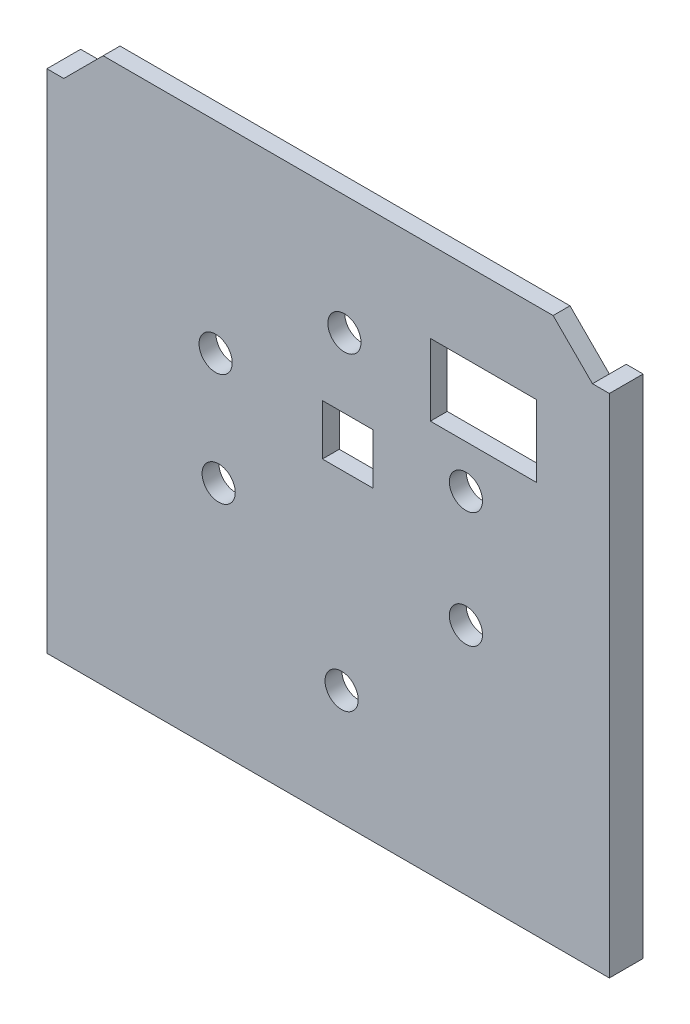
ISO-10303-21;
HEADER;
FILE_DESCRIPTION(('STEP AP214'),'2;1');
FILE_NAME('part.step','',(''),(''),'','','');
FILE_SCHEMA(('AUTOMOTIVE_DESIGN { 1 0 10303 214 1 1 1 1 }'));
ENDSEC;
DATA;
#1=APPLICATION_CONTEXT('core data for automotive mechanical design processes');
#2=APPLICATION_PROTOCOL_DEFINITION('international standard','automotive_design',2000,#1);
#3=PRODUCT_CONTEXT('',#1,'mechanical');
#4=PRODUCT('Part','Part','',(#3));
#5=PRODUCT_RELATED_PRODUCT_CATEGORY('part','',(#4));
#6=PRODUCT_DEFINITION_FORMATION('','',#4);
#7=PRODUCT_DEFINITION_CONTEXT('part definition',#1,'design');
#8=PRODUCT_DEFINITION('design','',#6,#7);
#9=PRODUCT_DEFINITION_SHAPE('','',#8);
#10=(LENGTH_UNIT() NAMED_UNIT(*) SI_UNIT(.MILLI.,.METRE.));
#11=(NAMED_UNIT(*) PLANE_ANGLE_UNIT() SI_UNIT($,.RADIAN.));
#12=(NAMED_UNIT(*) SI_UNIT($,.STERADIAN.) SOLID_ANGLE_UNIT());
#13=UNCERTAINTY_MEASURE_WITH_UNIT(LENGTH_MEASURE(1.E-05),#10,'distance_accuracy_value','');
#14=(GEOMETRIC_REPRESENTATION_CONTEXT(3) GLOBAL_UNCERTAINTY_ASSIGNED_CONTEXT((#13)) GLOBAL_UNIT_ASSIGNED_CONTEXT((#10,
#11,#12)) REPRESENTATION_CONTEXT('',''));
#15=CARTESIAN_POINT('',(0.,0.,0.));
#16=DIRECTION('',(0.,0.,1.));
#17=DIRECTION('',(1.,0.,0.));
#18=AXIS2_PLACEMENT_3D('',#15,#16,#17);
#19=CARTESIAN_POINT('',(0.,0.,2.84373961342499));
#20=DIRECTION('',(0.,0.,-1.));
#21=DIRECTION('',(-1.,0.,0.));
#22=AXIS2_PLACEMENT_3D('',#19,#20,#21);
#23=PLANE('',#22);
#24=DIRECTION('',(0.,-1.,0.));
#25=VECTOR('',#24,1.);
#26=CARTESIAN_POINT('',(3.24857673426605,27.3921139274678,2.84373961342499));
#27=LINE('',#26,#25);
#28=CARTESIAN_POINT('',(3.24857673426605,36.3921139274678,2.84373961342499));
#29=VERTEX_POINT('',#28);
#30=CARTESIAN_POINT('',(3.24857673426605,27.3921139274678,2.84373961342499));
#31=VERTEX_POINT('',#30);
#32=EDGE_CURVE('E253',#29,#31,#27,.T.);
#33=ORIENTED_EDGE('',*,*,#32,.F.);
#34=DIRECTION('',(-1.,0.,0.));
#35=VECTOR('',#34,1.);
#36=CARTESIAN_POINT('',(3.24857673426605,36.3921139274678,2.84373961342499));
#37=LINE('',#36,#35);
#38=CARTESIAN_POINT('',(12.248576734266,36.3921139274678,2.84373961342499));
#39=VERTEX_POINT('',#38);
#40=EDGE_CURVE('E261',#39,#29,#37,.T.);
#41=ORIENTED_EDGE('',*,*,#40,.F.);
#42=DIRECTION('',(0.,1.,0.));
#43=VECTOR('',#42,1.);
#44=CARTESIAN_POINT('',(12.248576734266,27.3921139274678,2.84373961342499));
#45=LINE('',#44,#43);
#46=CARTESIAN_POINT('',(12.248576734266,27.3921139274678,2.84373961342499));
#47=VERTEX_POINT('',#46);
#48=EDGE_CURVE('E258',#47,#39,#45,.T.);
#49=ORIENTED_EDGE('',*,*,#48,.F.);
#50=DIRECTION('',(1.,0.,0.));
#51=VECTOR('',#50,1.);
#52=CARTESIAN_POINT('',(3.24857673426605,27.3921139274678,2.84373961342499));
#53=LINE('',#52,#51);
#54=EDGE_CURVE('E255',#31,#47,#53,.T.);
#55=ORIENTED_EDGE('',*,*,#54,.F.);
#56=EDGE_LOOP('',(#33,#41,#49,#55));
#57=FACE_BOUND('',#56,.T.);
#58=DIRECTION('',(-1.,0.,0.));
#59=VECTOR('',#58,1.);
#60=CARTESIAN_POINT('',(51.2611254994336,62.988673094376,2.84373961342499));
#61=LINE('',#60,#59);
#62=CARTESIAN_POINT('',(54.2611254994336,62.988673094376,2.84373961342499));
#63=VERTEX_POINT('',#62);
#64=CARTESIAN_POINT('',(51.2611254994336,62.988673094376,2.84373961342499));
#65=VERTEX_POINT('',#64);
#66=EDGE_CURVE('E320',#63,#65,#61,.T.);
#67=ORIENTED_EDGE('',*,*,#66,.T.);
#68=DIRECTION('',(-0.707106781186551,0.707106781186544,0.));
#69=VECTOR('',#68,1.);
#70=CARTESIAN_POINT('',(51.2611254994336,62.988673094376,2.84373961342499));
#71=LINE('',#70,#69);
#72=CARTESIAN_POINT('',(44.2611254994336,69.9886730943761,2.84373961342499));
#73=VERTEX_POINT('',#72);
#74=EDGE_CURVE('E323',#65,#73,#71,.T.);
#75=ORIENTED_EDGE('',*,*,#74,.T.);
#76=DIRECTION('',(-1.,0.,0.));
#77=VECTOR('',#76,1.);
#78=CARTESIAN_POINT('',(-35.7388745005663,69.9886730943761,2.84373961342499));
#79=LINE('',#78,#77);
#80=CARTESIAN_POINT('',(-35.7388745005663,69.9886730943761,2.84373961342499));
#81=VERTEX_POINT('',#80);
#82=EDGE_CURVE('E326',#73,#81,#79,.T.);
#83=ORIENTED_EDGE('',*,*,#82,.T.);
#84=DIRECTION('',(-0.707106781186551,-0.707106781186544,0.));
#85=VECTOR('',#84,1.);
#86=CARTESIAN_POINT('',(-42.7388745005664,62.988673094376,2.84373961342499));
#87=LINE('',#86,#85);
#88=CARTESIAN_POINT('',(-42.7388745005664,62.988673094376,2.84373961342499));
#89=VERTEX_POINT('',#88);
#90=EDGE_CURVE('E328',#81,#89,#87,.T.);
#91=ORIENTED_EDGE('',*,*,#90,.T.);
#92=DIRECTION('',(-1.,0.,0.));
#93=VECTOR('',#92,1.);
#94=CARTESIAN_POINT('',(-42.7388745005664,62.988673094376,2.84373961342499));
#95=LINE('',#94,#93);
#96=CARTESIAN_POINT('',(-45.7388745005664,62.988673094376,2.84373961342499));
#97=VERTEX_POINT('',#96);
#98=EDGE_CURVE('E330',#89,#97,#95,.T.);
#99=ORIENTED_EDGE('',*,*,#98,.T.);
#100=DIRECTION('',(0.,-1.,0.));
#101=VECTOR('',#100,1.);
#102=CARTESIAN_POINT('',(-45.7388745005664,62.988673094376,2.84373961342499));
#103=LINE('',#102,#101);
#104=CARTESIAN_POINT('',(-45.7388745005664,-27.011326905624,2.84373961342499));
#105=VERTEX_POINT('',#104);
#106=EDGE_CURVE('E332',#97,#105,#103,.T.);
#107=ORIENTED_EDGE('',*,*,#106,.T.);
#108=DIRECTION('',(1.,0.,0.));
#109=VECTOR('',#108,1.);
#110=CARTESIAN_POINT('',(-45.7388745005664,-27.011326905624,2.84373961342499));
#111=LINE('',#110,#109);
#112=CARTESIAN_POINT('',(54.2611254994337,-27.011326905624,2.84373961342499));
#113=VERTEX_POINT('',#112);
#114=EDGE_CURVE('E334',#105,#113,#111,.T.);
#115=ORIENTED_EDGE('',*,*,#114,.T.);
#116=DIRECTION('',(0.,1.,0.));
#117=VECTOR('',#116,1.);
#118=CARTESIAN_POINT('',(54.2611254994336,62.988673094376,2.84373961342499));
#119=LINE('',#118,#117);
#120=EDGE_CURVE('E174',#113,#63,#119,.T.);
#121=ORIENTED_EDGE('',*,*,#120,.T.);
#122=EDGE_LOOP('',(#67,#75,#83,#91,#99,#107,#115,#121));
#123=FACE_BOUND('',#122,.T.);
#124=CARTESIAN_POINT('',(7.1611245312307,48.7704431449017,2.84373961342499));
#125=DIRECTION('',(0.,0.,1.));
#126=DIRECTION('',(1.,0.,0.));
#127=AXIS2_PLACEMENT_3D('',#124,#125,#126);
#128=CIRCLE('',#127,2.95000117238807);
#129=CARTESIAN_POINT('',(10.1111257036188,48.7704431449017,2.84373961342499));
#130=VERTEX_POINT('',#129);
#131=EDGE_CURVE('E314',#130,#130,#128,.T.);
#132=ORIENTED_EDGE('',*,*,#131,.F.);
#133=EDGE_LOOP('',(#132));
#134=FACE_BOUND('',#133,.T.);
#135=CARTESIAN_POINT('',(28.7611250915144,35.1704438959202,2.84373961342499));
#136=DIRECTION('',(0.,0.,1.));
#137=DIRECTION('',(1.,0.,0.));
#138=AXIS2_PLACEMENT_3D('',#135,#136,#137);
#139=CIRCLE('',#138,2.95000117238806);
#140=CARTESIAN_POINT('',(31.7111262639024,35.1704438959202,2.84373961342499));
#141=VERTEX_POINT('',#140);
#142=EDGE_CURVE('E308',#141,#141,#139,.T.);
#143=ORIENTED_EDGE('',*,*,#142,.F.);
#144=EDGE_LOOP('',(#143));
#145=FACE_BOUND('',#144,.T.);
#146=CARTESIAN_POINT('',(28.7611250915144,14.5704434995493,2.84373961342499));
#147=DIRECTION('',(0.,0.,1.));
#148=DIRECTION('',(1.,0.,0.));
#149=AXIS2_PLACEMENT_3D('',#146,#147,#148);
#150=CIRCLE('',#149,2.95000117238806);
#151=CARTESIAN_POINT('',(31.7111262639024,14.5704434995493,2.84373961342499));
#152=VERTEX_POINT('',#151);
#153=EDGE_CURVE('E302',#152,#152,#150,.T.);
#154=ORIENTED_EDGE('',*,*,#153,.F.);
#155=EDGE_LOOP('',(#154));
#156=FACE_BOUND('',#155,.T.);
#157=CARTESIAN_POINT('',(6.66112724324203,-6.52955907425374,2.84373961342499));
#158=DIRECTION('',(0.,0.,1.));
#159=DIRECTION('',(1.,0.,0.));
#160=AXIS2_PLACEMENT_3D('',#157,#158,#159);
#161=CIRCLE('',#160,2.95000117238807);
#162=CARTESIAN_POINT('',(9.6111284156301,-6.52955907425374,2.84373961342499));
#163=VERTEX_POINT('',#162);
#164=EDGE_CURVE('E296',#163,#163,#161,.T.);
#165=ORIENTED_EDGE('',*,*,#164,.F.);
#166=EDGE_LOOP('',(#165));
#167=FACE_BOUND('',#166,.T.);
#168=CARTESIAN_POINT('',(-15.1988725028422,14.4704436694226,2.84373961342499));
#169=DIRECTION('',(0.,0.,1.));
#170=DIRECTION('',(1.,0.,0.));
#171=AXIS2_PLACEMENT_3D('',#168,#169,#170);
#172=CIRCLE('',#171,2.95000117238807);
#173=CARTESIAN_POINT('',(-12.2488713304541,14.4704436694226,2.84373961342499));
#174=VERTEX_POINT('',#173);
#175=EDGE_CURVE('E290',#174,#174,#172,.T.);
#176=ORIENTED_EDGE('',*,*,#175,.F.);
#177=EDGE_LOOP('',(#176));
#178=FACE_BOUND('',#177,.T.);
#179=CARTESIAN_POINT('',(-15.738875683346,34.1704455946526,2.84373961342499));
#180=DIRECTION('',(0.,0.,1.));
#181=DIRECTION('',(1.,0.,0.));
#182=AXIS2_PLACEMENT_3D('',#179,#180,#181);
#183=CIRCLE('',#182,2.95000117238807);
#184=CARTESIAN_POINT('',(-12.788874510958,34.1704455946526,2.84373961342499));
#185=VERTEX_POINT('',#184);
#186=EDGE_CURVE('E284',#185,#185,#183,.T.);
#187=ORIENTED_EDGE('',*,*,#186,.F.);
#188=EDGE_LOOP('',(#187));
#189=FACE_BOUND('',#188,.T.);
#190=DIRECTION('',(0.,-1.,0.));
#191=VECTOR('',#190,1.);
#192=CARTESIAN_POINT('',(22.4361260571096,55.5636739169201,2.84373961342499));
#193=LINE('',#192,#191);
#194=CARTESIAN_POINT('',(22.4361260571096,55.5636739169201,2.84373961342499));
#195=VERTEX_POINT('',#194);
#196=CARTESIAN_POINT('',(22.4361260571096,42.8136741553387,2.84373961342499));
#197=VERTEX_POINT('',#196);
#198=EDGE_CURVE('E224',#195,#197,#193,.T.);
#199=ORIENTED_EDGE('',*,*,#198,.F.);
#200=DIRECTION('',(-1.,0.,0.));
#201=VECTOR('',#200,1.);
#202=CARTESIAN_POINT('',(22.4361260571096,55.5636739169201,2.84373961342499));
#203=LINE('',#202,#201);
#204=CARTESIAN_POINT('',(41.2861257009719,55.5636739169201,2.84373961342499));
#205=VERTEX_POINT('',#204);
#206=EDGE_CURVE('E231',#205,#195,#203,.T.);
#207=ORIENTED_EDGE('',*,*,#206,.F.);
#208=DIRECTION('',(0.,1.,0.));
#209=VECTOR('',#208,1.);
#210=CARTESIAN_POINT('',(41.2861257009719,55.5636739169201,2.84373961342499));
#211=LINE('',#210,#209);
#212=CARTESIAN_POINT('',(41.2861257009719,42.8136741553387,2.84373961342499));
#213=VERTEX_POINT('',#212);
#214=EDGE_CURVE('E229',#213,#205,#211,.T.);
#215=ORIENTED_EDGE('',*,*,#214,.F.);
#216=DIRECTION('',(1.,0.,0.));
#217=VECTOR('',#216,1.);
#218=CARTESIAN_POINT('',(22.4361260571096,42.8136741553387,2.84373961342499));
#219=LINE('',#218,#217);
#220=EDGE_CURVE('E226',#197,#213,#219,.T.);
#221=ORIENTED_EDGE('',*,*,#220,.F.);
#222=EDGE_LOOP('',(#199,#207,#215,#221));
#223=FACE_BOUND('',#222,.T.);
#224=ADVANCED_FACE('F36',(#57,#123,#134,#145,#156,#167,#178,#189,#223),#23,.F.);
#225=CARTESIAN_POINT('',(0.,0.,-0.156260386575012));
#226=DIRECTION('',(0.,0.,-1.));
#227=DIRECTION('',(-1.,0.,0.));
#228=AXIS2_PLACEMENT_3D('',#225,#226,#227);
#229=PLANE('',#228);
#230=DIRECTION('',(0.,1.,0.));
#231=VECTOR('',#230,1.);
#232=CARTESIAN_POINT('',(51.2611254994336,62.988673094376,-0.156260386575012));
#233=LINE('',#232,#231);
#234=CARTESIAN_POINT('',(51.2611254994336,-24.011326905624,-0.156260386575012));
#235=VERTEX_POINT('',#234);
#236=CARTESIAN_POINT('',(51.2611254994336,62.988673094376,-0.156260386575012));
#237=VERTEX_POINT('',#236);
#238=EDGE_CURVE('E51',#235,#237,#233,.T.);
#239=ORIENTED_EDGE('',*,*,#238,.F.);
#240=DIRECTION('',(1.,0.,0.));
#241=VECTOR('',#240,1.);
#242=CARTESIAN_POINT('',(51.2611254994336,-24.011326905624,-0.156260386575012));
#243=LINE('',#242,#241);
#244=CARTESIAN_POINT('',(-42.7388745005664,-24.011326905624,-0.156260386575012));
#245=VERTEX_POINT('',#244);
#246=EDGE_CURVE('E194',#245,#235,#243,.T.);
#247=ORIENTED_EDGE('',*,*,#246,.F.);
#248=DIRECTION('',(0.,-1.,0.));
#249=VECTOR('',#248,1.);
#250=CARTESIAN_POINT('',(-42.7388745005664,-24.011326905624,-0.156260386575012));
#251=LINE('',#250,#249);
#252=CARTESIAN_POINT('',(-42.7388745005664,62.988673094376,-0.156260386575012));
#253=VERTEX_POINT('',#252);
#254=EDGE_CURVE('E208',#253,#245,#251,.T.);
#255=ORIENTED_EDGE('',*,*,#254,.F.);
#256=DIRECTION('',(-0.707106781186551,-0.707106781186544,0.));
#257=VECTOR('',#256,1.);
#258=CARTESIAN_POINT('',(-42.7388745005664,62.988673094376,-0.156260386575012));
#259=LINE('',#258,#257);
#260=CARTESIAN_POINT('',(-35.7388745005663,69.9886730943761,-0.156260386575012));
#261=VERTEX_POINT('',#260);
#262=EDGE_CURVE('E324',#261,#253,#259,.T.);
#263=ORIENTED_EDGE('',*,*,#262,.F.);
#264=DIRECTION('',(-1.,0.,0.));
#265=VECTOR('',#264,1.);
#266=CARTESIAN_POINT('',(-35.7388745005663,69.9886730943761,-0.156260386575012));
#267=LINE('',#266,#265);
#268=CARTESIAN_POINT('',(44.2611254994336,69.9886730943761,-0.156260386575012));
#269=VERTEX_POINT('',#268);
#270=EDGE_CURVE('E338',#269,#261,#267,.T.);
#271=ORIENTED_EDGE('',*,*,#270,.F.);
#272=DIRECTION('',(-0.707106781186551,0.707106781186544,0.));
#273=VECTOR('',#272,1.);
#274=CARTESIAN_POINT('',(51.2611254994336,62.988673094376,-0.156260386575012));
#275=LINE('',#274,#273);
#276=EDGE_CURVE('E317',#237,#269,#275,.T.);
#277=ORIENTED_EDGE('',*,*,#276,.F.);
#278=EDGE_LOOP('',(#239,#247,#255,#263,#271,#277));
#279=FACE_BOUND('',#278,.T.);
#280=CARTESIAN_POINT('',(-15.1988725028422,14.4704436694226,-0.156260386575012));
#281=DIRECTION('',(0.,0.,1.));
#282=DIRECTION('',(1.,0.,0.));
#283=AXIS2_PLACEMENT_3D('',#280,#281,#282);
#284=CIRCLE('',#283,2.95000117238807);
#285=CARTESIAN_POINT('',(-12.2488713304541,14.4704436694226,-0.156260386575012));
#286=VERTEX_POINT('',#285);
#287=EDGE_CURVE('E287',#286,#286,#284,.T.);
#288=ORIENTED_EDGE('',*,*,#287,.T.);
#289=EDGE_LOOP('',(#288));
#290=FACE_BOUND('',#289,.T.);
#291=CARTESIAN_POINT('',(28.7611250915144,14.5704434995493,-0.156260386575012));
#292=DIRECTION('',(0.,0.,1.));
#293=DIRECTION('',(1.,0.,0.));
#294=AXIS2_PLACEMENT_3D('',#291,#292,#293);
#295=CIRCLE('',#294,2.95000117238806);
#296=CARTESIAN_POINT('',(31.7111262639024,14.5704434995493,-0.156260386575012));
#297=VERTEX_POINT('',#296);
#298=EDGE_CURVE('E299',#297,#297,#295,.T.);
#299=ORIENTED_EDGE('',*,*,#298,.T.);
#300=EDGE_LOOP('',(#299));
#301=FACE_BOUND('',#300,.T.);
#302=CARTESIAN_POINT('',(7.1611245312307,48.7704431449017,-0.156260386575012));
#303=DIRECTION('',(0.,0.,1.));
#304=DIRECTION('',(1.,0.,0.));
#305=AXIS2_PLACEMENT_3D('',#302,#303,#304);
#306=CIRCLE('',#305,2.95000117238807);
#307=CARTESIAN_POINT('',(10.1111257036188,48.7704431449017,-0.156260386575012));
#308=VERTEX_POINT('',#307);
#309=EDGE_CURVE('E311',#308,#308,#306,.T.);
#310=ORIENTED_EDGE('',*,*,#309,.T.);
#311=EDGE_LOOP('',(#310));
#312=FACE_BOUND('',#311,.T.);
#313=CARTESIAN_POINT('',(28.7611250915144,35.1704438959202,-0.156260386575012));
#314=DIRECTION('',(0.,0.,1.));
#315=DIRECTION('',(1.,0.,0.));
#316=AXIS2_PLACEMENT_3D('',#313,#314,#315);
#317=CIRCLE('',#316,2.95000117238806);
#318=CARTESIAN_POINT('',(31.7111262639024,35.1704438959202,-0.156260386575012));
#319=VERTEX_POINT('',#318);
#320=EDGE_CURVE('E305',#319,#319,#317,.T.);
#321=ORIENTED_EDGE('',*,*,#320,.T.);
#322=EDGE_LOOP('',(#321));
#323=FACE_BOUND('',#322,.T.);
#324=CARTESIAN_POINT('',(6.66112724324203,-6.52955907425374,-0.156260386575012));
#325=DIRECTION('',(0.,0.,1.));
#326=DIRECTION('',(1.,0.,0.));
#327=AXIS2_PLACEMENT_3D('',#324,#325,#326);
#328=CIRCLE('',#327,2.95000117238807);
#329=CARTESIAN_POINT('',(9.6111284156301,-6.52955907425374,-0.156260386575012));
#330=VERTEX_POINT('',#329);
#331=EDGE_CURVE('E293',#330,#330,#328,.T.);
#332=ORIENTED_EDGE('',*,*,#331,.T.);
#333=EDGE_LOOP('',(#332));
#334=FACE_BOUND('',#333,.T.);
#335=CARTESIAN_POINT('',(-15.738875683346,34.1704455946526,-0.156260386575012));
#336=DIRECTION('',(0.,0.,1.));
#337=DIRECTION('',(1.,0.,0.));
#338=AXIS2_PLACEMENT_3D('',#335,#336,#337);
#339=CIRCLE('',#338,2.95000117238807);
#340=CARTESIAN_POINT('',(-12.788874510958,34.1704455946526,-0.156260386575012));
#341=VERTEX_POINT('',#340);
#342=EDGE_CURVE('E283',#341,#341,#339,.T.);
#343=ORIENTED_EDGE('',*,*,#342,.T.);
#344=EDGE_LOOP('',(#343));
#345=FACE_BOUND('',#344,.T.);
#346=DIRECTION('',(-1.,0.,0.));
#347=VECTOR('',#346,1.);
#348=CARTESIAN_POINT('',(3.24857673426605,36.3921139274678,-0.156260386575012));
#349=LINE('',#348,#347);
#350=CARTESIAN_POINT('',(12.248576734266,36.3921139274678,-0.156260386575012));
#351=VERTEX_POINT('',#350);
#352=CARTESIAN_POINT('',(3.24857673426605,36.3921139274678,-0.156260386575012));
#353=VERTEX_POINT('',#352);
#354=EDGE_CURVE('E256',#351,#353,#349,.T.);
#355=ORIENTED_EDGE('',*,*,#354,.T.);
#356=DIRECTION('',(0.,-1.,0.));
#357=VECTOR('',#356,1.);
#358=CARTESIAN_POINT('',(3.24857673426605,27.3921139274678,-0.156260386575012));
#359=LINE('',#358,#357);
#360=CARTESIAN_POINT('',(3.24857673426605,27.3921139274678,-0.156260386575012));
#361=VERTEX_POINT('',#360);
#362=EDGE_CURVE('E252',#353,#361,#359,.T.);
#363=ORIENTED_EDGE('',*,*,#362,.T.);
#364=DIRECTION('',(1.,0.,0.));
#365=VECTOR('',#364,1.);
#366=CARTESIAN_POINT('',(3.24857673426605,27.3921139274678,-0.156260386575012));
#367=LINE('',#366,#365);
#368=CARTESIAN_POINT('',(12.248576734266,27.3921139274678,-0.156260386575012));
#369=VERTEX_POINT('',#368);
#370=EDGE_CURVE('E266',#361,#369,#367,.T.);
#371=ORIENTED_EDGE('',*,*,#370,.T.);
#372=DIRECTION('',(0.,1.,0.));
#373=VECTOR('',#372,1.);
#374=CARTESIAN_POINT('',(12.248576734266,27.3921139274678,-0.156260386575012));
#375=LINE('',#374,#373);
#376=EDGE_CURVE('E269',#369,#351,#375,.T.);
#377=ORIENTED_EDGE('',*,*,#376,.T.);
#378=EDGE_LOOP('',(#355,#363,#371,#377));
#379=FACE_BOUND('',#378,.T.);
#380=DIRECTION('',(-1.,0.,0.));
#381=VECTOR('',#380,1.);
#382=CARTESIAN_POINT('',(22.4361260571096,55.5636739169201,-0.156260386575012));
#383=LINE('',#382,#381);
#384=CARTESIAN_POINT('',(41.2861257009719,55.5636739169201,-0.156260386575012));
#385=VERTEX_POINT('',#384);
#386=CARTESIAN_POINT('',(22.4361260571096,55.5636739169201,-0.156260386575012));
#387=VERTEX_POINT('',#386);
#388=EDGE_CURVE('E227',#385,#387,#383,.T.);
#389=ORIENTED_EDGE('',*,*,#388,.T.);
#390=DIRECTION('',(0.,-1.,0.));
#391=VECTOR('',#390,1.);
#392=CARTESIAN_POINT('',(22.4361260571096,55.5636739169201,-0.156260386575012));
#393=LINE('',#392,#391);
#394=CARTESIAN_POINT('',(22.4361260571096,42.8136741553387,-0.156260386575012));
#395=VERTEX_POINT('',#394);
#396=EDGE_CURVE('E223',#387,#395,#393,.T.);
#397=ORIENTED_EDGE('',*,*,#396,.T.);
#398=DIRECTION('',(1.,0.,0.));
#399=VECTOR('',#398,1.);
#400=CARTESIAN_POINT('',(22.4361260571096,42.8136741553387,-0.156260386575012));
#401=LINE('',#400,#399);
#402=CARTESIAN_POINT('',(41.2861257009719,42.8136741553387,-0.156260386575012));
#403=VERTEX_POINT('',#402);
#404=EDGE_CURVE('E236',#395,#403,#401,.T.);
#405=ORIENTED_EDGE('',*,*,#404,.T.);
#406=DIRECTION('',(0.,1.,0.));
#407=VECTOR('',#406,1.);
#408=CARTESIAN_POINT('',(41.2861257009719,55.5636739169201,-0.156260386575012));
#409=LINE('',#408,#407);
#410=EDGE_CURVE('E239',#403,#385,#409,.T.);
#411=ORIENTED_EDGE('',*,*,#410,.T.);
#412=EDGE_LOOP('',(#389,#397,#405,#411));
#413=FACE_BOUND('',#412,.T.);
#414=ADVANCED_FACE('F360',(#279,#290,#301,#312,#323,#334,#345,#379,#413),#229,.T.);
#415=CARTESIAN_POINT('',(51.2611254994336,62.988673094376,2.84373961342499));
#416=DIRECTION('',(0.,-1.,0.));
#417=DIRECTION('',(0.,0.,-1.));
#418=AXIS2_PLACEMENT_3D('',#415,#416,#417);
#419=PLANE('',#418);
#420=DIRECTION('',(0.,0.,-1.));
#421=VECTOR('',#420,1.);
#422=CARTESIAN_POINT('',(54.2611254994336,62.988673094376,2.84373961342499));
#423=LINE('',#422,#421);
#424=CARTESIAN_POINT('',(54.2611254994336,62.988673094376,-3.15626038657501));
#425=VERTEX_POINT('',#424);
#426=EDGE_CURVE('E178',#63,#425,#423,.T.);
#427=ORIENTED_EDGE('',*,*,#426,.T.);
#428=DIRECTION('',(1.,0.,0.));
#429=VECTOR('',#428,1.);
#430=CARTESIAN_POINT('',(54.2611254994336,62.988673094376,-3.15626038657501));
#431=LINE('',#430,#429);
#432=CARTESIAN_POINT('',(51.2611254994336,62.988673094376,-3.15626038657501));
#433=VERTEX_POINT('',#432);
#434=EDGE_CURVE('E192',#433,#425,#431,.T.);
#435=ORIENTED_EDGE('',*,*,#434,.F.);
#436=DIRECTION('',(0.,0.,1.));
#437=VECTOR('',#436,1.);
#438=CARTESIAN_POINT('',(51.2611254994336,62.988673094376,-3.15626038657501));
#439=LINE('',#438,#437);
#440=EDGE_CURVE('E207',#433,#237,#439,.T.);
#441=ORIENTED_EDGE('',*,*,#440,.T.);
#442=DIRECTION('',(0.,0.,-1.));
#443=VECTOR('',#442,1.);
#444=CARTESIAN_POINT('',(51.2611254994336,62.988673094376,2.84373961342499));
#445=LINE('',#444,#443);
#446=EDGE_CURVE('E11',#65,#237,#445,.T.);
#447=ORIENTED_EDGE('',*,*,#446,.F.);
#448=ORIENTED_EDGE('',*,*,#66,.F.);
#449=EDGE_LOOP('',(#427,#435,#441,#447,#448));
#450=FACE_BOUND('',#449,.T.);
#451=ADVANCED_FACE('F38',(#450),#419,.F.);
#452=CARTESIAN_POINT('',(51.2611254994336,62.988673094376,2.84373961342499));
#453=DIRECTION('',(-0.707106781186544,-0.707106781186551,0.));
#454=DIRECTION('',(0.707106781186551,-0.707106781186544,0.));
#455=AXIS2_PLACEMENT_3D('',#452,#453,#454);
#456=PLANE('',#455);
#457=ORIENTED_EDGE('',*,*,#276,.T.);
#458=DIRECTION('',(0.,0.,-1.));
#459=VECTOR('',#458,1.);
#460=CARTESIAN_POINT('',(44.2611254994336,69.9886730943761,2.84373961342499));
#461=LINE('',#460,#459);
#462=EDGE_CURVE('E44',#73,#269,#461,.T.);
#463=ORIENTED_EDGE('',*,*,#462,.F.);
#464=ORIENTED_EDGE('',*,*,#74,.F.);
#465=ORIENTED_EDGE('',*,*,#446,.T.);
#466=EDGE_LOOP('',(#457,#463,#464,#465));
#467=FACE_BOUND('',#466,.T.);
#468=ADVANCED_FACE('F385',(#467),#456,.F.);
#469=CARTESIAN_POINT('',(-35.7388745005663,69.9886730943761,2.84373961342499));
#470=DIRECTION('',(0.,-1.,0.));
#471=DIRECTION('',(0.,0.,-1.));
#472=AXIS2_PLACEMENT_3D('',#469,#470,#471);
#473=PLANE('',#472);
#474=ORIENTED_EDGE('',*,*,#270,.T.);
#475=DIRECTION('',(0.,0.,-1.));
#476=VECTOR('',#475,1.);
#477=CARTESIAN_POINT('',(-35.7388745005663,69.9886730943761,2.84373961342499));
#478=LINE('',#477,#476);
#479=EDGE_CURVE('E349',#81,#261,#478,.T.);
#480=ORIENTED_EDGE('',*,*,#479,.F.);
#481=ORIENTED_EDGE('',*,*,#82,.F.);
#482=ORIENTED_EDGE('',*,*,#462,.T.);
#483=EDGE_LOOP('',(#474,#480,#481,#482));
#484=FACE_BOUND('',#483,.T.);
#485=ADVANCED_FACE('F356',(#484),#473,.F.);
#486=CARTESIAN_POINT('',(-42.7388745005664,62.988673094376,2.84373961342499));
#487=DIRECTION('',(0.707106781186544,-0.707106781186551,0.));
#488=DIRECTION('',(0.707106781186551,0.707106781186544,0.));
#489=AXIS2_PLACEMENT_3D('',#486,#487,#488);
#490=PLANE('',#489);
#491=ORIENTED_EDGE('',*,*,#262,.T.);
#492=DIRECTION('',(0.,0.,-1.));
#493=VECTOR('',#492,1.);
#494=CARTESIAN_POINT('',(-42.7388745005664,62.988673094376,2.84373961342499));
#495=LINE('',#494,#493);
#496=EDGE_CURVE('E346',#89,#253,#495,.T.);
#497=ORIENTED_EDGE('',*,*,#496,.F.);
#498=ORIENTED_EDGE('',*,*,#90,.F.);
#499=ORIENTED_EDGE('',*,*,#479,.T.);
#500=EDGE_LOOP('',(#491,#497,#498,#499));
#501=FACE_BOUND('',#500,.T.);
#502=ADVANCED_FACE('F364',(#501),#490,.F.);
#503=CARTESIAN_POINT('',(-42.7388745005664,62.988673094376,2.84373961342499));
#504=DIRECTION('',(0.,-1.,0.));
#505=DIRECTION('',(0.,0.,-1.));
#506=AXIS2_PLACEMENT_3D('',#503,#504,#505);
#507=PLANE('',#506);
#508=ORIENTED_EDGE('',*,*,#496,.T.);
#509=DIRECTION('',(0.,0.,1.));
#510=VECTOR('',#509,1.);
#511=CARTESIAN_POINT('',(-42.7388745005664,62.988673094376,-3.15626038657501));
#512=LINE('',#511,#510);
#513=CARTESIAN_POINT('',(-42.7388745005664,62.988673094376,-3.15626038657501));
#514=VERTEX_POINT('',#513);
#515=EDGE_CURVE('E220',#514,#253,#512,.T.);
#516=ORIENTED_EDGE('',*,*,#515,.F.);
#517=DIRECTION('',(1.,0.,0.));
#518=VECTOR('',#517,1.);
#519=CARTESIAN_POINT('',(-42.7388745005664,62.988673094376,-3.15626038657501));
#520=LINE('',#519,#518);
#521=CARTESIAN_POINT('',(-45.7388745005664,62.988673094376,-3.15626038657501));
#522=VERTEX_POINT('',#521);
#523=EDGE_CURVE('E198',#522,#514,#520,.T.);
#524=ORIENTED_EDGE('',*,*,#523,.F.);
#525=DIRECTION('',(0.,0.,-1.));
#526=VECTOR('',#525,1.);
#527=CARTESIAN_POINT('',(-45.7388745005664,62.988673094376,2.84373961342499));
#528=LINE('',#527,#526);
#529=EDGE_CURVE('E344',#97,#522,#528,.T.);
#530=ORIENTED_EDGE('',*,*,#529,.F.);
#531=ORIENTED_EDGE('',*,*,#98,.F.);
#532=EDGE_LOOP('',(#508,#516,#524,#530,#531));
#533=FACE_BOUND('',#532,.T.);
#534=ADVANCED_FACE('F369',(#533),#507,.F.);
#535=CARTESIAN_POINT('',(-45.7388745005664,62.988673094376,2.84373961342499));
#536=DIRECTION('',(1.,0.,0.));
#537=DIRECTION('',(0.,1.,0.));
#538=AXIS2_PLACEMENT_3D('',#535,#536,#537);
#539=PLANE('',#538);
#540=ORIENTED_EDGE('',*,*,#529,.T.);
#541=DIRECTION('',(0.,1.,0.));
#542=VECTOR('',#541,1.);
#543=CARTESIAN_POINT('',(-45.7388745005664,62.988673094376,-3.15626038657501));
#544=LINE('',#543,#542);
#545=CARTESIAN_POINT('',(-45.7388745005664,-27.011326905624,-3.15626038657501));
#546=VERTEX_POINT('',#545);
#547=EDGE_CURVE('E187',#546,#522,#544,.T.);
#548=ORIENTED_EDGE('',*,*,#547,.F.);
#549=DIRECTION('',(0.,0.,-1.));
#550=VECTOR('',#549,1.);
#551=CARTESIAN_POINT('',(-45.7388745005664,-27.011326905624,2.84373961342499));
#552=LINE('',#551,#550);
#553=EDGE_CURVE('E177',#105,#546,#552,.T.);
#554=ORIENTED_EDGE('',*,*,#553,.F.);
#555=ORIENTED_EDGE('',*,*,#106,.F.);
#556=EDGE_LOOP('',(#540,#548,#554,#555));
#557=FACE_BOUND('',#556,.T.);
#558=ADVANCED_FACE('F380',(#557),#539,.F.);
#559=CARTESIAN_POINT('',(-45.7388745005664,-27.011326905624,2.84373961342499));
#560=DIRECTION('',(0.,1.,0.));
#561=DIRECTION('',(-1.,0.,0.));
#562=AXIS2_PLACEMENT_3D('',#559,#560,#561);
#563=PLANE('',#562);
#564=ORIENTED_EDGE('',*,*,#553,.T.);
#565=DIRECTION('',(-1.,0.,0.));
#566=VECTOR('',#565,1.);
#567=CARTESIAN_POINT('',(-45.7388745005664,-27.011326905624,-3.15626038657501));
#568=LINE('',#567,#566);
#569=CARTESIAN_POINT('',(54.2611254994337,-27.011326905624,-3.15626038657501));
#570=VERTEX_POINT('',#569);
#571=EDGE_CURVE('E181',#570,#546,#568,.T.);
#572=ORIENTED_EDGE('',*,*,#571,.F.);
#573=DIRECTION('',(0.,0.,-1.));
#574=VECTOR('',#573,1.);
#575=CARTESIAN_POINT('',(54.2611254994337,-27.011326905624,2.84373961342499));
#576=LINE('',#575,#574);
#577=EDGE_CURVE('E168',#113,#570,#576,.T.);
#578=ORIENTED_EDGE('',*,*,#577,.F.);
#579=ORIENTED_EDGE('',*,*,#114,.F.);
#580=EDGE_LOOP('',(#564,#572,#578,#579));
#581=FACE_BOUND('',#580,.T.);
#582=ADVANCED_FACE('F182',(#581),#563,.F.);
#583=CARTESIAN_POINT('',(54.2611254994336,62.988673094376,2.84373961342499));
#584=DIRECTION('',(-1.,0.,0.));
#585=DIRECTION('',(0.,-1.,0.));
#586=AXIS2_PLACEMENT_3D('',#583,#584,#585);
#587=PLANE('',#586);
#588=ORIENTED_EDGE('',*,*,#577,.T.);
#589=DIRECTION('',(0.,-1.,0.));
#590=VECTOR('',#589,1.);
#591=CARTESIAN_POINT('',(54.2611254994337,-27.011326905624,-3.15626038657501));
#592=LINE('',#591,#590);
#593=EDGE_CURVE('E173',#425,#570,#592,.T.);
#594=ORIENTED_EDGE('',*,*,#593,.F.);
#595=ORIENTED_EDGE('',*,*,#426,.F.);
#596=ORIENTED_EDGE('',*,*,#120,.F.);
#597=EDGE_LOOP('',(#588,#594,#595,#596));
#598=FACE_BOUND('',#597,.T.);
#599=ADVANCED_FACE('F170',(#598),#587,.F.);
#600=CARTESIAN_POINT('',(7.1611245312307,48.7704431449017,2.84373961342499));
#601=DIRECTION('',(0.,0.,-1.));
#602=DIRECTION('',(-1.,0.,0.));
#603=AXIS2_PLACEMENT_3D('',#600,#601,#602);
#604=CYLINDRICAL_SURFACE('',#603,2.95000117238807);
#605=ORIENTED_EDGE('',*,*,#131,.T.);
#606=EDGE_LOOP('',(#605));
#607=FACE_BOUND('',#606,.T.);
#608=ORIENTED_EDGE('',*,*,#309,.F.);
#609=EDGE_LOOP('',(#608));
#610=FACE_BOUND('',#609,.T.);
#611=ADVANCED_FACE('F404',(#607,#610),#604,.F.);
#612=CARTESIAN_POINT('',(28.7611250915144,35.1704438959202,2.84373961342499));
#613=DIRECTION('',(0.,0.,-1.));
#614=DIRECTION('',(-1.,0.,0.));
#615=AXIS2_PLACEMENT_3D('',#612,#613,#614);
#616=CYLINDRICAL_SURFACE('',#615,2.95000117238806);
#617=ORIENTED_EDGE('',*,*,#142,.T.);
#618=EDGE_LOOP('',(#617));
#619=FACE_BOUND('',#618,.T.);
#620=ORIENTED_EDGE('',*,*,#320,.F.);
#621=EDGE_LOOP('',(#620));
#622=FACE_BOUND('',#621,.T.);
#623=ADVANCED_FACE('F449',(#619,#622),#616,.F.);
#624=CARTESIAN_POINT('',(28.7611250915144,14.5704434995493,2.84373961342499));
#625=DIRECTION('',(0.,0.,-1.));
#626=DIRECTION('',(-1.,0.,0.));
#627=AXIS2_PLACEMENT_3D('',#624,#625,#626);
#628=CYLINDRICAL_SURFACE('',#627,2.95000117238806);
#629=ORIENTED_EDGE('',*,*,#153,.T.);
#630=EDGE_LOOP('',(#629));
#631=FACE_BOUND('',#630,.T.);
#632=ORIENTED_EDGE('',*,*,#298,.F.);
#633=EDGE_LOOP('',(#632));
#634=FACE_BOUND('',#633,.T.);
#635=ADVANCED_FACE('F456',(#631,#634),#628,.F.);
#636=CARTESIAN_POINT('',(6.66112724324203,-6.52955907425374,2.84373961342499));
#637=DIRECTION('',(0.,0.,-1.));
#638=DIRECTION('',(-1.,0.,0.));
#639=AXIS2_PLACEMENT_3D('',#636,#637,#638);
#640=CYLINDRICAL_SURFACE('',#639,2.95000117238807);
#641=ORIENTED_EDGE('',*,*,#164,.T.);
#642=EDGE_LOOP('',(#641));
#643=FACE_BOUND('',#642,.T.);
#644=ORIENTED_EDGE('',*,*,#331,.F.);
#645=EDGE_LOOP('',(#644));
#646=FACE_BOUND('',#645,.T.);
#647=ADVANCED_FACE('F463',(#643,#646),#640,.F.);
#648=CARTESIAN_POINT('',(-15.1988725028422,14.4704436694226,2.84373961342499));
#649=DIRECTION('',(0.,0.,-1.));
#650=DIRECTION('',(-1.,0.,0.));
#651=AXIS2_PLACEMENT_3D('',#648,#649,#650);
#652=CYLINDRICAL_SURFACE('',#651,2.95000117238807);
#653=ORIENTED_EDGE('',*,*,#175,.T.);
#654=EDGE_LOOP('',(#653));
#655=FACE_BOUND('',#654,.T.);
#656=ORIENTED_EDGE('',*,*,#287,.F.);
#657=EDGE_LOOP('',(#656));
#658=FACE_BOUND('',#657,.T.);
#659=ADVANCED_FACE('F471',(#655,#658),#652,.F.);
#660=CARTESIAN_POINT('',(-15.738875683346,34.1704455946526,2.84373961342499));
#661=DIRECTION('',(0.,0.,-1.));
#662=DIRECTION('',(-1.,0.,0.));
#663=AXIS2_PLACEMENT_3D('',#660,#661,#662);
#664=CYLINDRICAL_SURFACE('',#663,2.95000117238807);
#665=ORIENTED_EDGE('',*,*,#186,.T.);
#666=EDGE_LOOP('',(#665));
#667=FACE_BOUND('',#666,.T.);
#668=ORIENTED_EDGE('',*,*,#342,.F.);
#669=EDGE_LOOP('',(#668));
#670=FACE_BOUND('',#669,.T.);
#671=ADVANCED_FACE('F479',(#667,#670),#664,.F.);
#672=CARTESIAN_POINT('',(3.24857673426605,27.3921139274678,2.84373961342499));
#673=DIRECTION('',(1.,0.,0.));
#674=DIRECTION('',(0.,0.,-1.));
#675=AXIS2_PLACEMENT_3D('',#672,#673,#674);
#676=PLANE('',#675);
#677=ORIENTED_EDGE('',*,*,#362,.F.);
#678=DIRECTION('',(0.,0.,-1.));
#679=VECTOR('',#678,1.);
#680=CARTESIAN_POINT('',(3.24857673426605,36.3921139274678,2.84373961342499));
#681=LINE('',#680,#679);
#682=EDGE_CURVE('E263',#29,#353,#681,.T.);
#683=ORIENTED_EDGE('',*,*,#682,.F.);
#684=ORIENTED_EDGE('',*,*,#32,.T.);
#685=DIRECTION('',(0.,0.,-1.));
#686=VECTOR('',#685,1.);
#687=CARTESIAN_POINT('',(3.24857673426605,27.3921139274678,2.84373961342499));
#688=LINE('',#687,#686);
#689=EDGE_CURVE('E280',#31,#361,#688,.T.);
#690=ORIENTED_EDGE('',*,*,#689,.T.);
#691=EDGE_LOOP('',(#677,#683,#684,#690));
#692=FACE_BOUND('',#691,.T.);
#693=ADVANCED_FACE('F487',(#692),#676,.T.);
#694=CARTESIAN_POINT('',(3.24857673426605,27.3921139274678,2.84373961342499));
#695=DIRECTION('',(0.,1.,0.));
#696=DIRECTION('',(0.,0.,1.));
#697=AXIS2_PLACEMENT_3D('',#694,#695,#696);
#698=PLANE('',#697);
#699=ORIENTED_EDGE('',*,*,#370,.F.);
#700=ORIENTED_EDGE('',*,*,#689,.F.);
#701=ORIENTED_EDGE('',*,*,#54,.T.);
#702=DIRECTION('',(0.,0.,-1.));
#703=VECTOR('',#702,1.);
#704=CARTESIAN_POINT('',(12.248576734266,27.3921139274678,2.84373961342499));
#705=LINE('',#704,#703);
#706=EDGE_CURVE('E278',#47,#369,#705,.T.);
#707=ORIENTED_EDGE('',*,*,#706,.T.);
#708=EDGE_LOOP('',(#699,#700,#701,#707));
#709=FACE_BOUND('',#708,.T.);
#710=ADVANCED_FACE('F495',(#709),#698,.T.);
#711=CARTESIAN_POINT('',(12.248576734266,27.3921139274678,2.84373961342499));
#712=DIRECTION('',(-1.,0.,0.));
#713=DIRECTION('',(0.,0.,1.));
#714=AXIS2_PLACEMENT_3D('',#711,#712,#713);
#715=PLANE('',#714);
#716=ORIENTED_EDGE('',*,*,#376,.F.);
#717=ORIENTED_EDGE('',*,*,#706,.F.);
#718=ORIENTED_EDGE('',*,*,#48,.T.);
#719=DIRECTION('',(0.,0.,-1.));
#720=VECTOR('',#719,1.);
#721=CARTESIAN_POINT('',(12.248576734266,36.3921139274678,2.84373961342499));
#722=LINE('',#721,#720);
#723=EDGE_CURVE('E276',#39,#351,#722,.T.);
#724=ORIENTED_EDGE('',*,*,#723,.T.);
#725=EDGE_LOOP('',(#716,#717,#718,#724));
#726=FACE_BOUND('',#725,.T.);
#727=ADVANCED_FACE('F503',(#726),#715,.T.);
#728=CARTESIAN_POINT('',(3.24857673426605,36.3921139274678,2.84373961342499));
#729=DIRECTION('',(0.,-1.,0.));
#730=DIRECTION('',(0.,0.,-1.));
#731=AXIS2_PLACEMENT_3D('',#728,#729,#730);
#732=PLANE('',#731);
#733=ORIENTED_EDGE('',*,*,#354,.F.);
#734=ORIENTED_EDGE('',*,*,#723,.F.);
#735=ORIENTED_EDGE('',*,*,#40,.T.);
#736=ORIENTED_EDGE('',*,*,#682,.T.);
#737=EDGE_LOOP('',(#733,#734,#735,#736));
#738=FACE_BOUND('',#737,.T.);
#739=ADVANCED_FACE('F511',(#738),#732,.T.);
#740=CARTESIAN_POINT('',(22.4361260571096,55.5636739169201,2.84373961342499));
#741=DIRECTION('',(1.,0.,0.));
#742=DIRECTION('',(0.,0.,-1.));
#743=AXIS2_PLACEMENT_3D('',#740,#741,#742);
#744=PLANE('',#743);
#745=ORIENTED_EDGE('',*,*,#396,.F.);
#746=DIRECTION('',(0.,0.,-1.));
#747=VECTOR('',#746,1.);
#748=CARTESIAN_POINT('',(22.4361260571096,55.5636739169201,2.84373961342499));
#749=LINE('',#748,#747);
#750=EDGE_CURVE('E233',#195,#387,#749,.T.);
#751=ORIENTED_EDGE('',*,*,#750,.F.);
#752=ORIENTED_EDGE('',*,*,#198,.T.);
#753=DIRECTION('',(0.,0.,-1.));
#754=VECTOR('',#753,1.);
#755=CARTESIAN_POINT('',(22.4361260571096,42.8136741553387,2.84373961342499));
#756=LINE('',#755,#754);
#757=EDGE_CURVE('E249',#197,#395,#756,.T.);
#758=ORIENTED_EDGE('',*,*,#757,.T.);
#759=EDGE_LOOP('',(#745,#751,#752,#758));
#760=FACE_BOUND('',#759,.T.);
#761=ADVANCED_FACE('F519',(#760),#744,.T.);
#762=CARTESIAN_POINT('',(22.4361260571096,42.8136741553387,2.84373961342499));
#763=DIRECTION('',(0.,1.,0.));
#764=DIRECTION('',(0.,0.,1.));
#765=AXIS2_PLACEMENT_3D('',#762,#763,#764);
#766=PLANE('',#765);
#767=ORIENTED_EDGE('',*,*,#404,.F.);
#768=ORIENTED_EDGE('',*,*,#757,.F.);
#769=ORIENTED_EDGE('',*,*,#220,.T.);
#770=DIRECTION('',(0.,0.,-1.));
#771=VECTOR('',#770,1.);
#772=CARTESIAN_POINT('',(41.2861257009719,42.8136741553387,2.84373961342499));
#773=LINE('',#772,#771);
#774=EDGE_CURVE('E247',#213,#403,#773,.T.);
#775=ORIENTED_EDGE('',*,*,#774,.T.);
#776=EDGE_LOOP('',(#767,#768,#769,#775));
#777=FACE_BOUND('',#776,.T.);
#778=ADVANCED_FACE('F527',(#777),#766,.T.);
#779=CARTESIAN_POINT('',(41.2861257009719,55.5636739169201,2.84373961342499));
#780=DIRECTION('',(-1.,0.,0.));
#781=DIRECTION('',(0.,0.,1.));
#782=AXIS2_PLACEMENT_3D('',#779,#780,#781);
#783=PLANE('',#782);
#784=ORIENTED_EDGE('',*,*,#410,.F.);
#785=ORIENTED_EDGE('',*,*,#774,.F.);
#786=ORIENTED_EDGE('',*,*,#214,.T.);
#787=DIRECTION('',(0.,0.,-1.));
#788=VECTOR('',#787,1.);
#789=CARTESIAN_POINT('',(41.2861257009719,55.5636739169201,2.84373961342499));
#790=LINE('',#789,#788);
#791=EDGE_CURVE('E59',#205,#385,#790,.T.);
#792=ORIENTED_EDGE('',*,*,#791,.T.);
#793=EDGE_LOOP('',(#784,#785,#786,#792));
#794=FACE_BOUND('',#793,.T.);
#795=ADVANCED_FACE('F535',(#794),#783,.T.);
#796=CARTESIAN_POINT('',(22.4361260571096,55.5636739169201,2.84373961342499));
#797=DIRECTION('',(0.,-1.,0.));
#798=DIRECTION('',(0.,0.,-1.));
#799=AXIS2_PLACEMENT_3D('',#796,#797,#798);
#800=PLANE('',#799);
#801=ORIENTED_EDGE('',*,*,#388,.F.);
#802=ORIENTED_EDGE('',*,*,#791,.F.);
#803=ORIENTED_EDGE('',*,*,#206,.T.);
#804=ORIENTED_EDGE('',*,*,#750,.T.);
#805=EDGE_LOOP('',(#801,#802,#803,#804));
#806=FACE_BOUND('',#805,.T.);
#807=ADVANCED_FACE('F543',(#806),#800,.T.);
#808=CARTESIAN_POINT('',(-42.7388745005664,-24.011326905624,-3.15626038657501));
#809=DIRECTION('',(-1.,0.,0.));
#810=DIRECTION('',(0.,0.,1.));
#811=AXIS2_PLACEMENT_3D('',#808,#809,#810);
#812=PLANE('',#811);
#813=ORIENTED_EDGE('',*,*,#254,.T.);
#814=DIRECTION('',(0.,0.,1.));
#815=VECTOR('',#814,1.);
#816=CARTESIAN_POINT('',(-42.7388745005664,-24.011326905624,-3.15626038657501));
#817=LINE('',#816,#815);
#818=CARTESIAN_POINT('',(-42.7388745005664,-24.011326905624,-3.15626038657501));
#819=VERTEX_POINT('',#818);
#820=EDGE_CURVE('E217',#819,#245,#817,.T.);
#821=ORIENTED_EDGE('',*,*,#820,.F.);
#822=DIRECTION('',(0.,-1.,0.));
#823=VECTOR('',#822,1.);
#824=CARTESIAN_POINT('',(-42.7388745005664,-24.011326905624,-3.15626038657501));
#825=LINE('',#824,#823);
#826=EDGE_CURVE('E200',#514,#819,#825,.T.);
#827=ORIENTED_EDGE('',*,*,#826,.F.);
#828=ORIENTED_EDGE('',*,*,#515,.T.);
#829=EDGE_LOOP('',(#813,#821,#827,#828));
#830=FACE_BOUND('',#829,.T.);
#831=ADVANCED_FACE('F374',(#830),#812,.F.);
#832=CARTESIAN_POINT('',(51.2611254994336,-24.011326905624,-3.15626038657501));
#833=DIRECTION('',(0.,-1.,0.));
#834=DIRECTION('',(1.,0.,0.));
#835=AXIS2_PLACEMENT_3D('',#832,#833,#834);
#836=PLANE('',#835);
#837=ORIENTED_EDGE('',*,*,#246,.T.);
#838=DIRECTION('',(0.,0.,1.));
#839=VECTOR('',#838,1.);
#840=CARTESIAN_POINT('',(51.2611254994336,-24.011326905624,-3.15626038657501));
#841=LINE('',#840,#839);
#842=CARTESIAN_POINT('',(51.2611254994336,-24.011326905624,-3.15626038657501));
#843=VERTEX_POINT('',#842);
#844=EDGE_CURVE('E214',#843,#235,#841,.T.);
#845=ORIENTED_EDGE('',*,*,#844,.F.);
#846=DIRECTION('',(1.,0.,0.));
#847=VECTOR('',#846,1.);
#848=CARTESIAN_POINT('',(51.2611254994336,-24.011326905624,-3.15626038657501));
#849=LINE('',#848,#847);
#850=EDGE_CURVE('E202',#819,#843,#849,.T.);
#851=ORIENTED_EDGE('',*,*,#850,.F.);
#852=ORIENTED_EDGE('',*,*,#820,.T.);
#853=EDGE_LOOP('',(#837,#845,#851,#852));
#854=FACE_BOUND('',#853,.T.);
#855=ADVANCED_FACE('F557',(#854),#836,.F.);
#856=CARTESIAN_POINT('',(51.2611254994336,62.988673094376,-3.15626038657501));
#857=DIRECTION('',(1.,0.,0.));
#858=DIRECTION('',(0.,1.,0.));
#859=AXIS2_PLACEMENT_3D('',#856,#857,#858);
#860=PLANE('',#859);
#861=ORIENTED_EDGE('',*,*,#238,.T.);
#862=ORIENTED_EDGE('',*,*,#440,.F.);
#863=DIRECTION('',(0.,1.,0.));
#864=VECTOR('',#863,1.);
#865=CARTESIAN_POINT('',(51.2611254994336,62.988673094376,-3.15626038657501));
#866=LINE('',#865,#864);
#867=EDGE_CURVE('E204',#843,#433,#866,.T.);
#868=ORIENTED_EDGE('',*,*,#867,.F.);
#869=ORIENTED_EDGE('',*,*,#844,.T.);
#870=EDGE_LOOP('',(#861,#862,#868,#869));
#871=FACE_BOUND('',#870,.T.);
#872=ADVANCED_FACE('F389',(#871),#860,.F.);
#873=CARTESIAN_POINT('',(0.,0.,-3.15626038657501));
#874=DIRECTION('',(0.,0.,1.));
#875=DIRECTION('',(1.,0.,0.));
#876=AXIS2_PLACEMENT_3D('',#873,#874,#875);
#877=PLANE('',#876);
#878=ORIENTED_EDGE('',*,*,#593,.T.);
#879=ORIENTED_EDGE('',*,*,#571,.T.);
#880=ORIENTED_EDGE('',*,*,#547,.T.);
#881=ORIENTED_EDGE('',*,*,#523,.T.);
#882=ORIENTED_EDGE('',*,*,#826,.T.);
#883=ORIENTED_EDGE('',*,*,#850,.T.);
#884=ORIENTED_EDGE('',*,*,#867,.T.);
#885=ORIENTED_EDGE('',*,*,#434,.T.);
#886=EDGE_LOOP('',(#878,#879,#880,#881,#882,#883,#884,#885));
#887=FACE_BOUND('',#886,.T.);
#888=ADVANCED_FACE('F190',(#887),#877,.F.);
#889=CLOSED_SHELL('',(#224,#414,#451,#468,#485,#502,#534,#558,#582,#599,#611,#623,#635,#647,
#659,#671,#693,#710,#727,#739,#761,#778,#795,#807,#831,#855,#872,#888));
#890=MANIFOLD_SOLID_BREP('B2',#889);
#891=ADVANCED_BREP_SHAPE_REPRESENTATION('',(#18,#890),#14);
#892=SHAPE_DEFINITION_REPRESENTATION(#9,#891);
ENDSEC;
END-ISO-10303-21;
